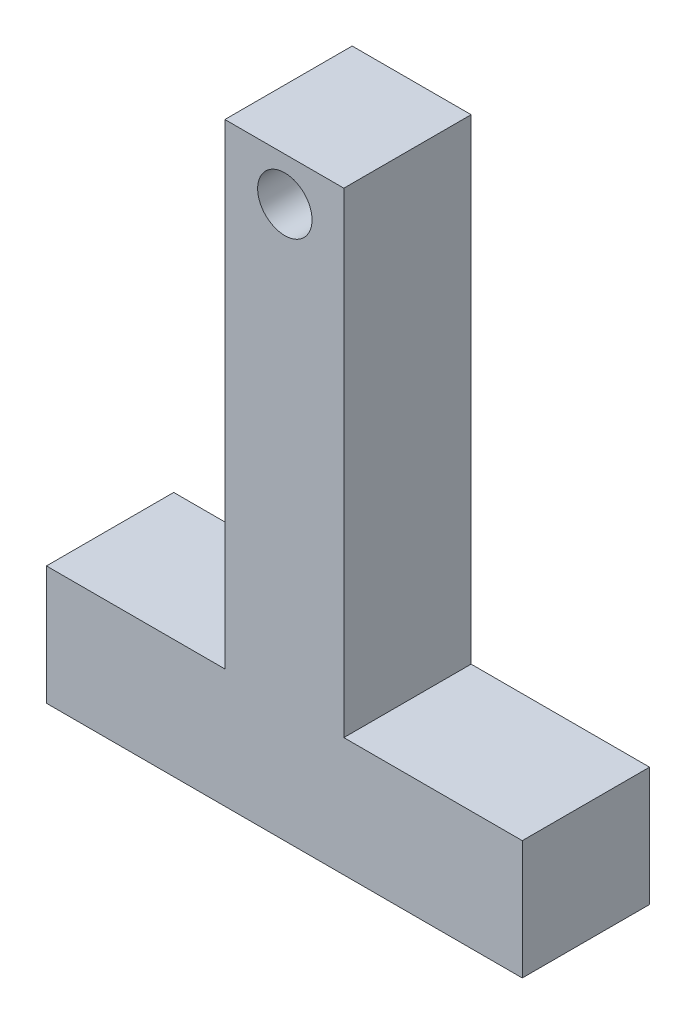
ISO-10303-21;
HEADER;
FILE_DESCRIPTION(('STEP AP214'),'2;1');
FILE_NAME('part.step','',(''),(''),'','','');
FILE_SCHEMA(('AUTOMOTIVE_DESIGN { 1 0 10303 214 1 1 1 1 }'));
ENDSEC;
DATA;
#1=APPLICATION_CONTEXT('core data for automotive mechanical design processes');
#2=APPLICATION_PROTOCOL_DEFINITION('international standard','automotive_design',2000,#1);
#3=PRODUCT_CONTEXT('',#1,'mechanical');
#4=PRODUCT('Part','Part','',(#3));
#5=PRODUCT_RELATED_PRODUCT_CATEGORY('part','',(#4));
#6=PRODUCT_DEFINITION_FORMATION('','',#4);
#7=PRODUCT_DEFINITION_CONTEXT('part definition',#1,'design');
#8=PRODUCT_DEFINITION('design','',#6,#7);
#9=PRODUCT_DEFINITION_SHAPE('','',#8);
#10=(LENGTH_UNIT() NAMED_UNIT(*) SI_UNIT(.MILLI.,.METRE.));
#11=(NAMED_UNIT(*) PLANE_ANGLE_UNIT() SI_UNIT($,.RADIAN.));
#12=(NAMED_UNIT(*) SI_UNIT($,.STERADIAN.) SOLID_ANGLE_UNIT());
#13=UNCERTAINTY_MEASURE_WITH_UNIT(LENGTH_MEASURE(1.E-05),#10,'distance_accuracy_value','');
#14=(GEOMETRIC_REPRESENTATION_CONTEXT(3) GLOBAL_UNCERTAINTY_ASSIGNED_CONTEXT((#13)) GLOBAL_UNIT_ASSIGNED_CONTEXT((#10,
#11,#12)) REPRESENTATION_CONTEXT('',''));
#15=CARTESIAN_POINT('',(0.,0.,0.));
#16=DIRECTION('',(0.,0.,1.));
#17=DIRECTION('',(1.,0.,0.));
#18=AXIS2_PLACEMENT_3D('',#15,#16,#17);
#19=CARTESIAN_POINT('',(0.,127.,-1.27));
#20=DIRECTION('',(0.,1.,0.));
#21=DIRECTION('',(0.,0.,1.));
#22=AXIS2_PLACEMENT_3D('',#19,#20,#21);
#23=PLANE('',#22);
#24=DIRECTION('',(0.,0.,1.));
#25=VECTOR('',#24,1.);
#26=CARTESIAN_POINT('',(38.1,127.,-1.27));
#27=LINE('',#26,#25);
#28=CARTESIAN_POINT('',(38.1,127.,-1.27));
#29=VERTEX_POINT('',#28);
#30=CARTESIAN_POINT('',(38.1,127.,25.908));
#31=VERTEX_POINT('',#30);
#32=EDGE_CURVE('E104',#29,#31,#27,.T.);
#33=ORIENTED_EDGE('',*,*,#32,.T.);
#34=DIRECTION('',(-1.,0.,0.));
#35=VECTOR('',#34,1.);
#36=CARTESIAN_POINT('',(0.,127.,25.908));
#37=LINE('',#36,#35);
#38=CARTESIAN_POINT('',(63.5,127.,25.908));
#39=VERTEX_POINT('',#38);
#40=EDGE_CURVE('E107',#39,#31,#37,.T.);
#41=ORIENTED_EDGE('',*,*,#40,.F.);
#42=DIRECTION('',(0.,0.,1.));
#43=VECTOR('',#42,1.);
#44=CARTESIAN_POINT('',(63.5,127.,-1.27));
#45=LINE('',#44,#43);
#46=CARTESIAN_POINT('',(63.5,127.,-1.27));
#47=VERTEX_POINT('',#46);
#48=EDGE_CURVE('E11',#47,#39,#45,.T.);
#49=ORIENTED_EDGE('',*,*,#48,.F.);
#50=DIRECTION('',(-1.,0.,0.));
#51=VECTOR('',#50,1.);
#52=CARTESIAN_POINT('',(0.,127.,-1.27));
#53=LINE('',#52,#51);
#54=EDGE_CURVE('E109',#47,#29,#53,.T.);
#55=ORIENTED_EDGE('',*,*,#54,.T.);
#56=EDGE_LOOP('',(#33,#41,#49,#55));
#57=FACE_BOUND('',#56,.T.);
#58=ADVANCED_FACE('F41',(#57),#23,.T.);
#59=CARTESIAN_POINT('',(63.5,0.,-1.27));
#60=DIRECTION('',(-1.,0.,0.));
#61=DIRECTION('',(0.,-1.,0.));
#62=AXIS2_PLACEMENT_3D('',#59,#60,#61);
#63=PLANE('',#62);
#64=ORIENTED_EDGE('',*,*,#48,.T.);
#65=DIRECTION('',(0.,-1.,0.));
#66=VECTOR('',#65,1.);
#67=CARTESIAN_POINT('',(63.5,0.,25.908));
#68=LINE('',#67,#66);
#69=CARTESIAN_POINT('',(63.5,25.4,25.908));
#70=VERTEX_POINT('',#69);
#71=EDGE_CURVE('E128',#39,#70,#68,.T.);
#72=ORIENTED_EDGE('',*,*,#71,.T.);
#73=DIRECTION('',(0.,0.,1.));
#74=VECTOR('',#73,1.);
#75=CARTESIAN_POINT('',(63.5,25.4,-1.27));
#76=LINE('',#75,#74);
#77=CARTESIAN_POINT('',(63.5,25.4,-1.27));
#78=VERTEX_POINT('',#77);
#79=EDGE_CURVE('E50',#78,#70,#76,.T.);
#80=ORIENTED_EDGE('',*,*,#79,.F.);
#81=DIRECTION('',(0.,-1.,0.));
#82=VECTOR('',#81,1.);
#83=CARTESIAN_POINT('',(63.5,0.,-1.27));
#84=LINE('',#83,#82);
#85=EDGE_CURVE('E63',#47,#78,#84,.T.);
#86=ORIENTED_EDGE('',*,*,#85,.F.);
#87=EDGE_LOOP('',(#64,#72,#80,#86));
#88=FACE_BOUND('',#87,.T.);
#89=ADVANCED_FACE('F199',(#88),#63,.F.);
#90=CARTESIAN_POINT('',(0.,25.4,-1.27));
#91=DIRECTION('',(0.,-1.,0.));
#92=DIRECTION('',(0.,0.,-1.));
#93=AXIS2_PLACEMENT_3D('',#90,#91,#92);
#94=PLANE('',#93);
#95=ORIENTED_EDGE('',*,*,#79,.T.);
#96=DIRECTION('',(1.,0.,0.));
#97=VECTOR('',#96,1.);
#98=CARTESIAN_POINT('',(0.,25.4,25.908));
#99=LINE('',#98,#97);
#100=CARTESIAN_POINT('',(101.6,25.4,25.908));
#101=VERTEX_POINT('',#100);
#102=EDGE_CURVE('E139',#70,#101,#99,.T.);
#103=ORIENTED_EDGE('',*,*,#102,.T.);
#104=DIRECTION('',(0.,0.,1.));
#105=VECTOR('',#104,1.);
#106=CARTESIAN_POINT('',(101.6,25.4,-1.27));
#107=LINE('',#106,#105);
#108=CARTESIAN_POINT('',(101.6,25.4,-1.27));
#109=VERTEX_POINT('',#108);
#110=EDGE_CURVE('E177',#109,#101,#107,.T.);
#111=ORIENTED_EDGE('',*,*,#110,.F.);
#112=DIRECTION('',(1.,0.,0.));
#113=VECTOR('',#112,1.);
#114=CARTESIAN_POINT('',(0.,25.4,-1.27));
#115=LINE('',#114,#113);
#116=EDGE_CURVE('E162',#78,#109,#115,.T.);
#117=ORIENTED_EDGE('',*,*,#116,.F.);
#118=EDGE_LOOP('',(#95,#103,#111,#117));
#119=FACE_BOUND('',#118,.T.);
#120=ADVANCED_FACE('F195',(#119),#94,.F.);
#121=CARTESIAN_POINT('',(101.6,0.,-1.27));
#122=DIRECTION('',(1.,0.,0.));
#123=DIRECTION('',(0.,0.,-1.));
#124=AXIS2_PLACEMENT_3D('',#121,#122,#123);
#125=PLANE('',#124);
#126=ORIENTED_EDGE('',*,*,#110,.T.);
#127=DIRECTION('',(0.,1.,0.));
#128=VECTOR('',#127,1.);
#129=CARTESIAN_POINT('',(101.6,0.,25.908));
#130=LINE('',#129,#128);
#131=CARTESIAN_POINT('',(101.6,0.,25.908));
#132=VERTEX_POINT('',#131);
#133=EDGE_CURVE('E147',#132,#101,#130,.T.);
#134=ORIENTED_EDGE('',*,*,#133,.F.);
#135=DIRECTION('',(0.,0.,1.));
#136=VECTOR('',#135,1.);
#137=CARTESIAN_POINT('',(101.6,0.,-1.27));
#138=LINE('',#137,#136);
#139=CARTESIAN_POINT('',(101.6,0.,-1.27));
#140=VERTEX_POINT('',#139);
#141=EDGE_CURVE('E180',#140,#132,#138,.T.);
#142=ORIENTED_EDGE('',*,*,#141,.F.);
#143=DIRECTION('',(0.,1.,0.));
#144=VECTOR('',#143,1.);
#145=CARTESIAN_POINT('',(101.6,0.,-1.27));
#146=LINE('',#145,#144);
#147=EDGE_CURVE('E169',#140,#109,#146,.T.);
#148=ORIENTED_EDGE('',*,*,#147,.T.);
#149=EDGE_LOOP('',(#126,#134,#142,#148));
#150=FACE_BOUND('',#149,.T.);
#151=ADVANCED_FACE('F214',(#150),#125,.T.);
#152=CARTESIAN_POINT('',(0.,0.,-1.27));
#153=DIRECTION('',(0.,-1.,0.));
#154=DIRECTION('',(0.,0.,-1.));
#155=AXIS2_PLACEMENT_3D('',#152,#153,#154);
#156=PLANE('',#155);
#157=ORIENTED_EDGE('',*,*,#141,.T.);
#158=DIRECTION('',(1.,0.,0.));
#159=VECTOR('',#158,1.);
#160=CARTESIAN_POINT('',(0.,0.,25.908));
#161=LINE('',#160,#159);
#162=CARTESIAN_POINT('',(0.,0.,25.908));
#163=VERTEX_POINT('',#162);
#164=EDGE_CURVE('E143',#163,#132,#161,.T.);
#165=ORIENTED_EDGE('',*,*,#164,.F.);
#166=DIRECTION('',(0.,0.,1.));
#167=VECTOR('',#166,1.);
#168=CARTESIAN_POINT('',(0.,0.,-1.27));
#169=LINE('',#168,#167);
#170=CARTESIAN_POINT('',(0.,0.,-1.27));
#171=VERTEX_POINT('',#170);
#172=EDGE_CURVE('E183',#171,#163,#169,.T.);
#173=ORIENTED_EDGE('',*,*,#172,.F.);
#174=DIRECTION('',(1.,0.,0.));
#175=VECTOR('',#174,1.);
#176=CARTESIAN_POINT('',(0.,0.,-1.27));
#177=LINE('',#176,#175);
#178=EDGE_CURVE('E165',#171,#140,#177,.T.);
#179=ORIENTED_EDGE('',*,*,#178,.T.);
#180=EDGE_LOOP('',(#157,#165,#173,#179));
#181=FACE_BOUND('',#180,.T.);
#182=ADVANCED_FACE('F212',(#181),#156,.T.);
#183=CARTESIAN_POINT('',(0.,0.,-1.27));
#184=DIRECTION('',(1.,0.,0.));
#185=DIRECTION('',(0.,0.,-1.));
#186=AXIS2_PLACEMENT_3D('',#183,#184,#185);
#187=PLANE('',#186);
#188=ORIENTED_EDGE('',*,*,#172,.T.);
#189=DIRECTION('',(0.,1.,0.));
#190=VECTOR('',#189,1.);
#191=CARTESIAN_POINT('',(0.,0.,25.908));
#192=LINE('',#191,#190);
#193=CARTESIAN_POINT('',(0.,25.4,25.908));
#194=VERTEX_POINT('',#193);
#195=EDGE_CURVE('E138',#163,#194,#192,.T.);
#196=ORIENTED_EDGE('',*,*,#195,.T.);
#197=DIRECTION('',(0.,0.,1.));
#198=VECTOR('',#197,1.);
#199=CARTESIAN_POINT('',(0.,25.4,-1.27));
#200=LINE('',#199,#198);
#201=CARTESIAN_POINT('',(0.,25.4,-1.27));
#202=VERTEX_POINT('',#201);
#203=EDGE_CURVE('E186',#202,#194,#200,.T.);
#204=ORIENTED_EDGE('',*,*,#203,.F.);
#205=DIRECTION('',(0.,1.,0.));
#206=VECTOR('',#205,1.);
#207=CARTESIAN_POINT('',(0.,0.,-1.27));
#208=LINE('',#207,#206);
#209=EDGE_CURVE('E161',#171,#202,#208,.T.);
#210=ORIENTED_EDGE('',*,*,#209,.F.);
#211=EDGE_LOOP('',(#188,#196,#204,#210));
#212=FACE_BOUND('',#211,.T.);
#213=ADVANCED_FACE('F209',(#212),#187,.F.);
#214=ORIENTED_EDGE('',*,*,#203,.T.);
#215=CARTESIAN_POINT('',(38.1,25.4,25.908));
#216=VERTEX_POINT('',#215);
#217=EDGE_CURVE('E123',#194,#216,#99,.T.);
#218=ORIENTED_EDGE('',*,*,#217,.T.);
#219=DIRECTION('',(0.,0.,1.));
#220=VECTOR('',#219,1.);
#221=CARTESIAN_POINT('',(38.1,25.4,-1.27));
#222=LINE('',#221,#220);
#223=CARTESIAN_POINT('',(38.1,25.4,-1.27));
#224=VERTEX_POINT('',#223);
#225=EDGE_CURVE('E114',#224,#216,#222,.T.);
#226=ORIENTED_EDGE('',*,*,#225,.F.);
#227=EDGE_CURVE('E158',#202,#224,#115,.T.);
#228=ORIENTED_EDGE('',*,*,#227,.F.);
#229=EDGE_LOOP('',(#214,#218,#226,#228));
#230=FACE_BOUND('',#229,.T.);
#231=ADVANCED_FACE('F206',(#230),#94,.F.);
#232=CARTESIAN_POINT('',(38.1,0.,-1.27));
#233=DIRECTION('',(-1.,0.,0.));
#234=DIRECTION('',(0.,-1.,0.));
#235=AXIS2_PLACEMENT_3D('',#232,#233,#234);
#236=PLANE('',#235);
#237=ORIENTED_EDGE('',*,*,#225,.T.);
#238=DIRECTION('',(0.,-1.,0.));
#239=VECTOR('',#238,1.);
#240=CARTESIAN_POINT('',(38.1,0.,25.908));
#241=LINE('',#240,#239);
#242=EDGE_CURVE('E116',#31,#216,#241,.T.);
#243=ORIENTED_EDGE('',*,*,#242,.F.);
#244=ORIENTED_EDGE('',*,*,#32,.F.);
#245=DIRECTION('',(0.,-1.,0.));
#246=VECTOR('',#245,1.);
#247=CARTESIAN_POINT('',(38.1,0.,-1.27));
#248=LINE('',#247,#246);
#249=EDGE_CURVE('E155',#29,#224,#248,.T.);
#250=ORIENTED_EDGE('',*,*,#249,.T.);
#251=EDGE_LOOP('',(#237,#243,#244,#250));
#252=FACE_BOUND('',#251,.T.);
#253=ADVANCED_FACE('F117',(#252),#236,.T.);
#254=CARTESIAN_POINT('',(0.,0.,-1.27));
#255=DIRECTION('',(0.,0.,1.));
#256=DIRECTION('',(1.,0.,0.));
#257=AXIS2_PLACEMENT_3D('',#254,#255,#256);
#258=PLANE('',#257);
#259=CARTESIAN_POINT('',(50.9020677519199,117.730257346272,-1.27));
#260=DIRECTION('',(0.,0.,1.));
#261=DIRECTION('',(1.,0.,0.));
#262=AXIS2_PLACEMENT_3D('',#259,#260,#261);
#263=CIRCLE('',#262,5.80379314517837);
#264=CARTESIAN_POINT('',(56.7058608970983,117.730257346272,-1.27));
#265=VERTEX_POINT('',#264);
#266=EDGE_CURVE('E130',#265,#265,#263,.T.);
#267=ORIENTED_EDGE('',*,*,#266,.T.);
#268=EDGE_LOOP('',(#267));
#269=FACE_BOUND('',#268,.T.);
#270=ORIENTED_EDGE('',*,*,#54,.F.);
#271=ORIENTED_EDGE('',*,*,#85,.T.);
#272=ORIENTED_EDGE('',*,*,#116,.T.);
#273=ORIENTED_EDGE('',*,*,#147,.F.);
#274=ORIENTED_EDGE('',*,*,#178,.F.);
#275=ORIENTED_EDGE('',*,*,#209,.T.);
#276=ORIENTED_EDGE('',*,*,#227,.T.);
#277=ORIENTED_EDGE('',*,*,#249,.F.);
#278=EDGE_LOOP('',(#270,#271,#272,#273,#274,#275,#276,#277));
#279=FACE_BOUND('',#278,.T.);
#280=ADVANCED_FACE('F200',(#269,#279),#258,.F.);
#281=CARTESIAN_POINT('',(0.,0.,25.908));
#282=DIRECTION('',(0.,0.,1.));
#283=DIRECTION('',(1.,0.,0.));
#284=AXIS2_PLACEMENT_3D('',#281,#282,#283);
#285=PLANE('',#284);
#286=CARTESIAN_POINT('',(50.9020677519199,117.730257346272,25.908));
#287=DIRECTION('',(0.,0.,1.));
#288=DIRECTION('',(1.,0.,0.));
#289=AXIS2_PLACEMENT_3D('',#286,#287,#288);
#290=CIRCLE('',#289,5.80379314517837);
#291=CARTESIAN_POINT('',(56.7058608970983,117.730257346272,25.908));
#292=VERTEX_POINT('',#291);
#293=EDGE_CURVE('E44',#292,#292,#290,.T.);
#294=ORIENTED_EDGE('',*,*,#293,.F.);
#295=EDGE_LOOP('',(#294));
#296=FACE_BOUND('',#295,.T.);
#297=ORIENTED_EDGE('',*,*,#40,.T.);
#298=ORIENTED_EDGE('',*,*,#242,.T.);
#299=ORIENTED_EDGE('',*,*,#217,.F.);
#300=ORIENTED_EDGE('',*,*,#195,.F.);
#301=ORIENTED_EDGE('',*,*,#164,.T.);
#302=ORIENTED_EDGE('',*,*,#133,.T.);
#303=ORIENTED_EDGE('',*,*,#102,.F.);
#304=ORIENTED_EDGE('',*,*,#71,.F.);
#305=EDGE_LOOP('',(#297,#298,#299,#300,#301,#302,#303,#304));
#306=FACE_BOUND('',#305,.T.);
#307=ADVANCED_FACE('F125',(#296,#306),#285,.T.);
#308=CARTESIAN_POINT('',(50.9020677519199,117.730257346272,-13.462));
#309=DIRECTION('',(0.,0.,1.));
#310=DIRECTION('',(1.,0.,0.));
#311=AXIS2_PLACEMENT_3D('',#308,#309,#310);
#312=CYLINDRICAL_SURFACE('',#311,5.80379314517837);
#313=ORIENTED_EDGE('',*,*,#293,.T.);
#314=EDGE_LOOP('',(#313));
#315=FACE_BOUND('',#314,.T.);
#316=ORIENTED_EDGE('',*,*,#266,.F.);
#317=EDGE_LOOP('',(#316));
#318=FACE_BOUND('',#317,.T.);
#319=ADVANCED_FACE('F237',(#315,#318),#312,.F.);
#320=CLOSED_SHELL('',(#58,#89,#120,#151,#182,#213,#231,#253,#280,#307,#319));
#321=MANIFOLD_SOLID_BREP('B2',#320);
#322=ADVANCED_BREP_SHAPE_REPRESENTATION('',(#18,#321),#14);
#323=SHAPE_DEFINITION_REPRESENTATION(#9,#322);
ENDSEC;
END-ISO-10303-21;
